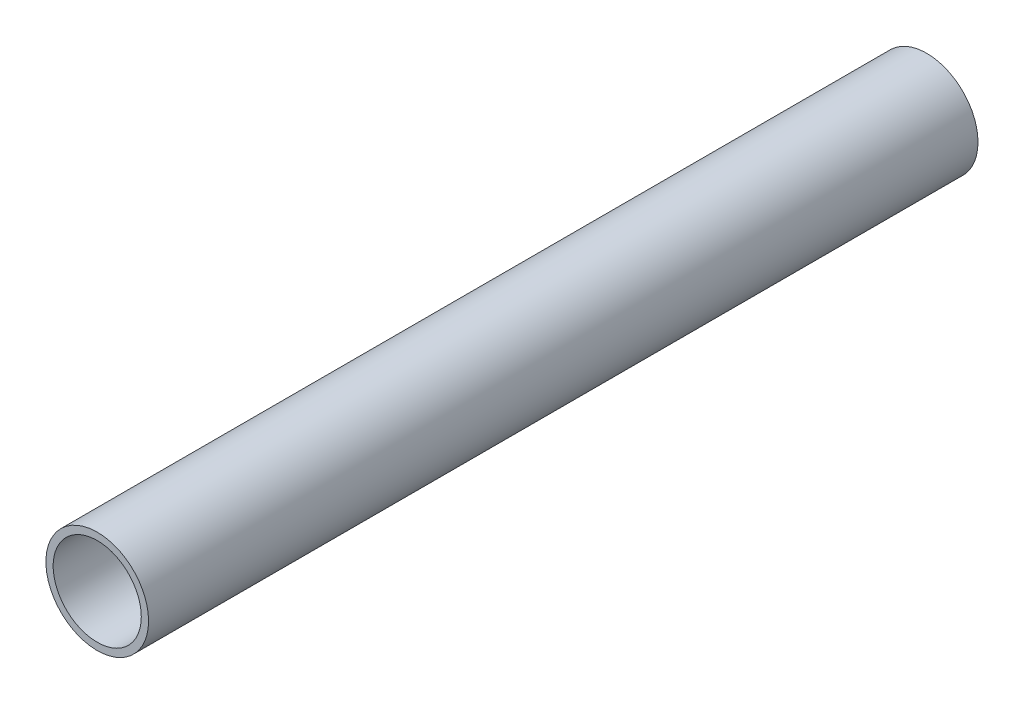
ISO-10303-21;
HEADER;
FILE_DESCRIPTION(('STEP AP214'),'2;1');
FILE_NAME('part.step','',(''),(''),'','','');
FILE_SCHEMA(('AUTOMOTIVE_DESIGN { 1 0 10303 214 1 1 1 1 }'));
ENDSEC;
DATA;
#1=APPLICATION_CONTEXT('core data for automotive mechanical design processes');
#2=APPLICATION_PROTOCOL_DEFINITION('international standard','automotive_design',2000,#1);
#3=PRODUCT_CONTEXT('',#1,'mechanical');
#4=PRODUCT('Part','Part','',(#3));
#5=PRODUCT_RELATED_PRODUCT_CATEGORY('part','',(#4));
#6=PRODUCT_DEFINITION_FORMATION('','',#4);
#7=PRODUCT_DEFINITION_CONTEXT('part definition',#1,'design');
#8=PRODUCT_DEFINITION('design','',#6,#7);
#9=PRODUCT_DEFINITION_SHAPE('','',#8);
#10=(LENGTH_UNIT() NAMED_UNIT(*) SI_UNIT(.MILLI.,.METRE.));
#11=(NAMED_UNIT(*) PLANE_ANGLE_UNIT() SI_UNIT($,.RADIAN.));
#12=(NAMED_UNIT(*) SI_UNIT($,.STERADIAN.) SOLID_ANGLE_UNIT());
#13=UNCERTAINTY_MEASURE_WITH_UNIT(LENGTH_MEASURE(1.E-05),#10,'distance_accuracy_value','');
#14=(GEOMETRIC_REPRESENTATION_CONTEXT(3) GLOBAL_UNCERTAINTY_ASSIGNED_CONTEXT((#13)) GLOBAL_UNIT_ASSIGNED_CONTEXT((#10,
#11,#12)) REPRESENTATION_CONTEXT('',''));
#15=CARTESIAN_POINT('',(0.,0.,0.));
#16=DIRECTION('',(0.,0.,1.));
#17=DIRECTION('',(1.,0.,0.));
#18=AXIS2_PLACEMENT_3D('',#15,#16,#17);
#19=CARTESIAN_POINT('',(0.,0.,203.2));
#20=DIRECTION('',(0.,0.,1.));
#21=DIRECTION('',(1.,0.,0.));
#22=AXIS2_PLACEMENT_3D('',#19,#20,#21);
#23=PLANE('',#22);
#24=CARTESIAN_POINT('',(0.,0.,203.2));
#25=DIRECTION('',(0.,0.,1.));
#26=DIRECTION('',(1.,0.,0.));
#27=AXIS2_PLACEMENT_3D('',#24,#25,#26);
#28=CIRCLE('',#27,12.573);
#29=CARTESIAN_POINT('',(12.573,0.,203.2));
#30=VERTEX_POINT('',#29);
#31=EDGE_CURVE('E10',#30,#30,#28,.T.);
#32=ORIENTED_EDGE('',*,*,#31,.T.);
#33=EDGE_LOOP('',(#32));
#34=FACE_BOUND('',#33,.T.);
#35=CARTESIAN_POINT('',(0.,0.,203.2));
#36=DIRECTION('',(0.,0.,1.));
#37=DIRECTION('',(1.,0.,0.));
#38=AXIS2_PLACEMENT_3D('',#35,#36,#37);
#39=CIRCLE('',#38,10.795);
#40=CARTESIAN_POINT('',(10.795,0.,203.2));
#41=VERTEX_POINT('',#40);
#42=EDGE_CURVE('E41',#41,#41,#39,.T.);
#43=ORIENTED_EDGE('',*,*,#42,.F.);
#44=EDGE_LOOP('',(#43));
#45=FACE_BOUND('',#44,.T.);
#46=ADVANCED_FACE('F30',(#34,#45),#23,.T.);
#47=CARTESIAN_POINT('',(0.,0.,0.));
#48=DIRECTION('',(0.,0.,1.));
#49=DIRECTION('',(1.,0.,0.));
#50=AXIS2_PLACEMENT_3D('',#47,#48,#49);
#51=PLANE('',#50);
#52=CARTESIAN_POINT('',(0.,0.,0.));
#53=DIRECTION('',(0.,0.,1.));
#54=DIRECTION('',(1.,0.,0.));
#55=AXIS2_PLACEMENT_3D('',#52,#53,#54);
#56=CIRCLE('',#55,12.573);
#57=CARTESIAN_POINT('',(12.573,0.,0.));
#58=VERTEX_POINT('',#57);
#59=EDGE_CURVE('E34',#58,#58,#56,.T.);
#60=ORIENTED_EDGE('',*,*,#59,.F.);
#61=EDGE_LOOP('',(#60));
#62=FACE_BOUND('',#61,.T.);
#63=CARTESIAN_POINT('',(0.,0.,0.));
#64=DIRECTION('',(0.,0.,1.));
#65=DIRECTION('',(1.,0.,0.));
#66=AXIS2_PLACEMENT_3D('',#63,#64,#65);
#67=CIRCLE('',#66,10.795);
#68=CARTESIAN_POINT('',(10.795,0.,0.));
#69=VERTEX_POINT('',#68);
#70=EDGE_CURVE('E43',#69,#69,#67,.T.);
#71=ORIENTED_EDGE('',*,*,#70,.T.);
#72=EDGE_LOOP('',(#71));
#73=FACE_BOUND('',#72,.T.);
#74=ADVANCED_FACE('F53',(#62,#73),#51,.F.);
#75=CARTESIAN_POINT('',(0.,0.,203.2));
#76=DIRECTION('',(0.,0.,-1.));
#77=DIRECTION('',(-1.,0.,0.));
#78=AXIS2_PLACEMENT_3D('',#75,#76,#77);
#79=CYLINDRICAL_SURFACE('',#78,12.573);
#80=ORIENTED_EDGE('',*,*,#31,.F.);
#81=EDGE_LOOP('',(#80));
#82=FACE_BOUND('',#81,.T.);
#83=ORIENTED_EDGE('',*,*,#59,.T.);
#84=EDGE_LOOP('',(#83));
#85=FACE_BOUND('',#84,.T.);
#86=ADVANCED_FACE('F32',(#82,#85),#79,.T.);
#87=CARTESIAN_POINT('',(0.,0.,203.2));
#88=DIRECTION('',(0.,0.,-1.));
#89=DIRECTION('',(-1.,0.,0.));
#90=AXIS2_PLACEMENT_3D('',#87,#88,#89);
#91=CYLINDRICAL_SURFACE('',#90,10.795);
#92=ORIENTED_EDGE('',*,*,#42,.T.);
#93=EDGE_LOOP('',(#92));
#94=FACE_BOUND('',#93,.T.);
#95=ORIENTED_EDGE('',*,*,#70,.F.);
#96=EDGE_LOOP('',(#95));
#97=FACE_BOUND('',#96,.T.);
#98=ADVANCED_FACE('F49',(#94,#97),#91,.F.);
#99=CLOSED_SHELL('',(#46,#74,#86,#98));
#100=MANIFOLD_SOLID_BREP('B2',#99);
#101=ADVANCED_BREP_SHAPE_REPRESENTATION('',(#18,#100),#14);
#102=SHAPE_DEFINITION_REPRESENTATION(#9,#101);
ENDSEC;
END-ISO-10303-21;
